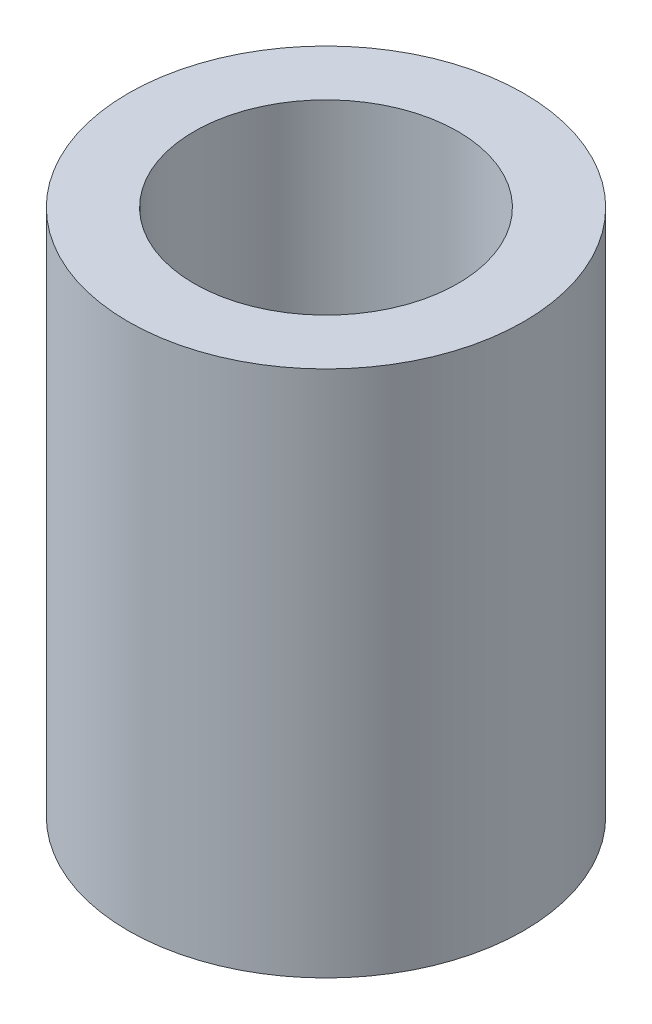
ISO-10303-21;
HEADER;
FILE_DESCRIPTION(('STEP AP214'),'2;1');
FILE_NAME('part.step','',(''),(''),'','','');
FILE_SCHEMA(('AUTOMOTIVE_DESIGN { 1 0 10303 214 1 1 1 1 }'));
ENDSEC;
DATA;
#1=APPLICATION_CONTEXT('core data for automotive mechanical design processes');
#2=APPLICATION_PROTOCOL_DEFINITION('international standard','automotive_design',2000,#1);
#3=PRODUCT_CONTEXT('',#1,'mechanical');
#4=PRODUCT('Part','Part','',(#3));
#5=PRODUCT_RELATED_PRODUCT_CATEGORY('part','',(#4));
#6=PRODUCT_DEFINITION_FORMATION('','',#4);
#7=PRODUCT_DEFINITION_CONTEXT('part definition',#1,'design');
#8=PRODUCT_DEFINITION('design','',#6,#7);
#9=PRODUCT_DEFINITION_SHAPE('','',#8);
#10=(LENGTH_UNIT() NAMED_UNIT(*) SI_UNIT(.MILLI.,.METRE.));
#11=(NAMED_UNIT(*) PLANE_ANGLE_UNIT() SI_UNIT($,.RADIAN.));
#12=(NAMED_UNIT(*) SI_UNIT($,.STERADIAN.) SOLID_ANGLE_UNIT());
#13=UNCERTAINTY_MEASURE_WITH_UNIT(LENGTH_MEASURE(1.E-05),#10,'distance_accuracy_value','');
#14=(GEOMETRIC_REPRESENTATION_CONTEXT(3) GLOBAL_UNCERTAINTY_ASSIGNED_CONTEXT((#13)) GLOBAL_UNIT_ASSIGNED_CONTEXT((#10,
#11,#12)) REPRESENTATION_CONTEXT('',''));
#15=CARTESIAN_POINT('',(0.,0.,0.));
#16=DIRECTION('',(0.,0.,1.));
#17=DIRECTION('',(1.,0.,0.));
#18=AXIS2_PLACEMENT_3D('',#15,#16,#17);
#19=CARTESIAN_POINT('',(0.,16.,0.));
#20=DIRECTION('',(0.,1.,0.));
#21=DIRECTION('',(0.,0.,1.));
#22=AXIS2_PLACEMENT_3D('',#19,#20,#21);
#23=PLANE('',#22);
#24=CARTESIAN_POINT('',(0.,16.,0.));
#25=DIRECTION('',(0.,1.,0.));
#26=DIRECTION('',(0.,0.,1.));
#27=AXIS2_PLACEMENT_3D('',#24,#25,#26);
#28=CIRCLE('',#27,6.);
#29=CARTESIAN_POINT('',(0.,16.,6.));
#30=VERTEX_POINT('',#29);
#31=EDGE_CURVE('E10',#30,#30,#28,.T.);
#32=ORIENTED_EDGE('',*,*,#31,.T.);
#33=EDGE_LOOP('',(#32));
#34=FACE_BOUND('',#33,.T.);
#35=CARTESIAN_POINT('',(0.,16.,0.));
#36=DIRECTION('',(0.,1.,0.));
#37=DIRECTION('',(0.,0.,1.));
#38=AXIS2_PLACEMENT_3D('',#35,#36,#37);
#39=CIRCLE('',#38,4.);
#40=CARTESIAN_POINT('',(0.,16.,4.));
#41=VERTEX_POINT('',#40);
#42=EDGE_CURVE('E50',#41,#41,#39,.T.);
#43=ORIENTED_EDGE('',*,*,#42,.F.);
#44=EDGE_LOOP('',(#43));
#45=FACE_BOUND('',#44,.T.);
#46=ADVANCED_FACE('F37',(#34,#45),#23,.T.);
#47=CARTESIAN_POINT('',(0.,0.,0.));
#48=DIRECTION('',(0.,1.,0.));
#49=DIRECTION('',(0.,0.,1.));
#50=AXIS2_PLACEMENT_3D('',#47,#48,#49);
#51=PLANE('',#50);
#52=CARTESIAN_POINT('',(0.,0.,0.));
#53=DIRECTION('',(0.,1.,0.));
#54=DIRECTION('',(0.,0.,1.));
#55=AXIS2_PLACEMENT_3D('',#52,#53,#54);
#56=CIRCLE('',#55,6.);
#57=CARTESIAN_POINT('',(0.,0.,6.));
#58=VERTEX_POINT('',#57);
#59=EDGE_CURVE('E41',#58,#58,#56,.T.);
#60=ORIENTED_EDGE('',*,*,#59,.F.);
#61=EDGE_LOOP('',(#60));
#62=FACE_BOUND('',#61,.T.);
#63=CARTESIAN_POINT('',(0.,0.,0.));
#64=DIRECTION('',(0.,1.,0.));
#65=DIRECTION('',(0.,0.,1.));
#66=AXIS2_PLACEMENT_3D('',#63,#64,#65);
#67=CIRCLE('',#66,4.);
#68=CARTESIAN_POINT('',(0.,0.,4.));
#69=VERTEX_POINT('',#68);
#70=EDGE_CURVE('E52',#69,#69,#67,.T.);
#71=ORIENTED_EDGE('',*,*,#70,.T.);
#72=EDGE_LOOP('',(#71));
#73=FACE_BOUND('',#72,.T.);
#74=ADVANCED_FACE('F64',(#62,#73),#51,.F.);
#75=CARTESIAN_POINT('',(0.,16.,0.));
#76=DIRECTION('',(0.,-1.,0.));
#77=DIRECTION('',(0.,0.,-1.));
#78=AXIS2_PLACEMENT_3D('',#75,#76,#77);
#79=CYLINDRICAL_SURFACE('',#78,6.);
#80=ORIENTED_EDGE('',*,*,#31,.F.);
#81=EDGE_LOOP('',(#80));
#82=FACE_BOUND('',#81,.T.);
#83=ORIENTED_EDGE('',*,*,#59,.T.);
#84=EDGE_LOOP('',(#83));
#85=FACE_BOUND('',#84,.T.);
#86=ADVANCED_FACE('F39',(#82,#85),#79,.T.);
#87=CARTESIAN_POINT('',(0.,16.,0.));
#88=DIRECTION('',(0.,-1.,0.));
#89=DIRECTION('',(0.,0.,-1.));
#90=AXIS2_PLACEMENT_3D('',#87,#88,#89);
#91=CYLINDRICAL_SURFACE('',#90,4.);
#92=ORIENTED_EDGE('',*,*,#42,.T.);
#93=EDGE_LOOP('',(#92));
#94=FACE_BOUND('',#93,.T.);
#95=ORIENTED_EDGE('',*,*,#70,.F.);
#96=EDGE_LOOP('',(#95));
#97=FACE_BOUND('',#96,.T.);
#98=ADVANCED_FACE('F60',(#94,#97),#91,.F.);
#99=CLOSED_SHELL('',(#46,#74,#86,#98));
#100=MANIFOLD_SOLID_BREP('B2',#99);
#101=ADVANCED_BREP_SHAPE_REPRESENTATION('',(#18,#100),#14);
#102=SHAPE_DEFINITION_REPRESENTATION(#9,#101);
ENDSEC;
END-ISO-10303-21;
